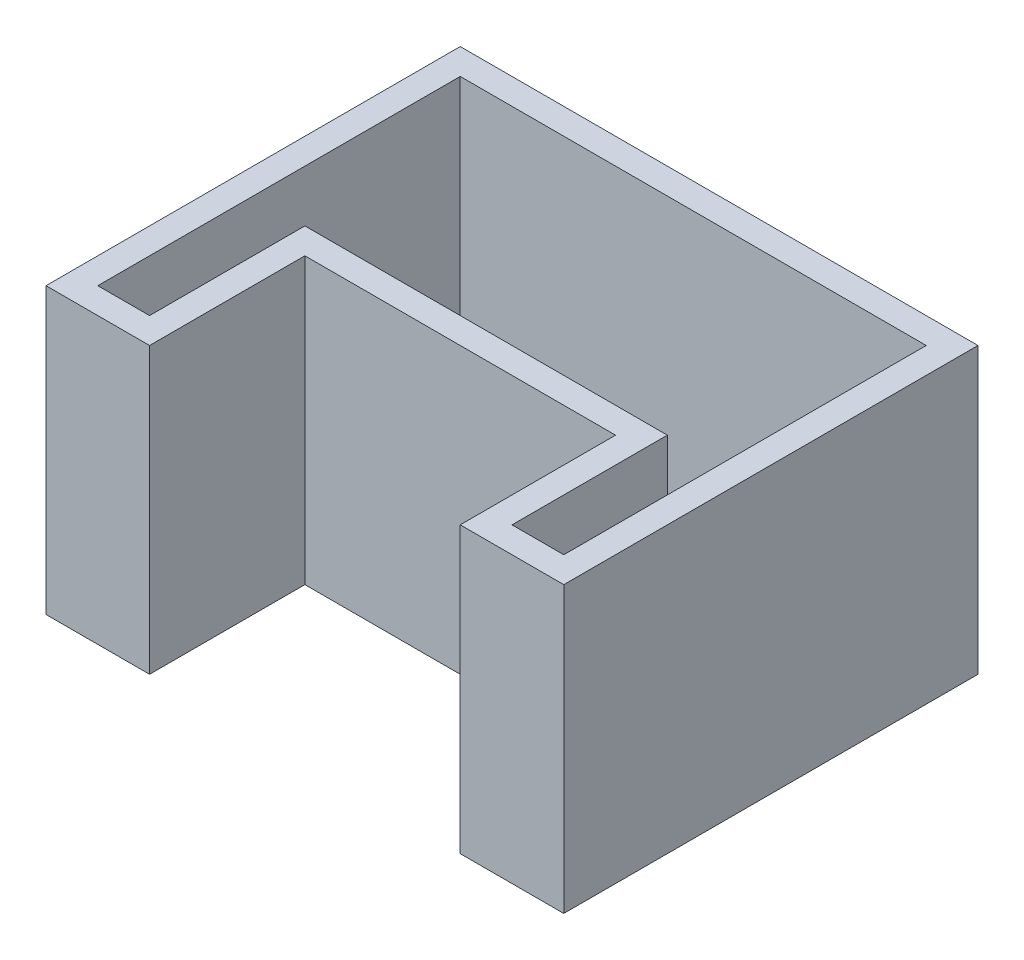
ISO-10303-21;
HEADER;
FILE_DESCRIPTION(('STEP AP214'),'2;1');
FILE_NAME('part.step','',(''),(''),'','','');
FILE_SCHEMA(('AUTOMOTIVE_DESIGN { 1 0 10303 214 1 1 1 1 }'));
ENDSEC;
DATA;
#1=APPLICATION_CONTEXT('core data for automotive mechanical design processes');
#2=APPLICATION_PROTOCOL_DEFINITION('international standard','automotive_design',2000,#1);
#3=PRODUCT_CONTEXT('',#1,'mechanical');
#4=PRODUCT('Part','Part','',(#3));
#5=PRODUCT_RELATED_PRODUCT_CATEGORY('part','',(#4));
#6=PRODUCT_DEFINITION_FORMATION('','',#4);
#7=PRODUCT_DEFINITION_CONTEXT('part definition',#1,'design');
#8=PRODUCT_DEFINITION('design','',#6,#7);
#9=PRODUCT_DEFINITION_SHAPE('','',#8);
#10=(LENGTH_UNIT() NAMED_UNIT(*) SI_UNIT(.MILLI.,.METRE.));
#11=(NAMED_UNIT(*) PLANE_ANGLE_UNIT() SI_UNIT($,.RADIAN.));
#12=(NAMED_UNIT(*) SI_UNIT($,.STERADIAN.) SOLID_ANGLE_UNIT());
#13=UNCERTAINTY_MEASURE_WITH_UNIT(LENGTH_MEASURE(1.E-05),#10,'distance_accuracy_value','');
#14=(GEOMETRIC_REPRESENTATION_CONTEXT(3) GLOBAL_UNCERTAINTY_ASSIGNED_CONTEXT((#13)) GLOBAL_UNIT_ASSIGNED_CONTEXT((#10,
#11,#12)) REPRESENTATION_CONTEXT('',''));
#15=CARTESIAN_POINT('',(0.,0.,0.));
#16=DIRECTION('',(0.,0.,1.));
#17=DIRECTION('',(1.,0.,0.));
#18=AXIS2_PLACEMENT_3D('',#15,#16,#17);
#19=CARTESIAN_POINT('',(60.,10.,80.));
#20=DIRECTION('',(0.,0.,-1.));
#21=DIRECTION('',(-1.,0.,0.));
#22=AXIS2_PLACEMENT_3D('',#19,#20,#21);
#23=PLANE('',#22);
#24=DIRECTION('',(1.,0.,0.));
#25=VECTOR('',#24,1.);
#26=CARTESIAN_POINT('',(60.,0.,80.));
#27=LINE('',#26,#25);
#28=CARTESIAN_POINT('',(60.,0.,80.));
#29=VERTEX_POINT('',#28);
#30=CARTESIAN_POINT('',(100.,0.,80.));
#31=VERTEX_POINT('',#30);
#32=EDGE_CURVE('E241',#29,#31,#27,.T.);
#33=ORIENTED_EDGE('',*,*,#32,.T.);
#34=DIRECTION('',(0.,-1.,0.));
#35=VECTOR('',#34,1.);
#36=CARTESIAN_POINT('',(100.,10.,80.));
#37=LINE('',#36,#35);
#38=CARTESIAN_POINT('',(100.,110.,80.));
#39=VERTEX_POINT('',#38);
#40=EDGE_CURVE('E11',#39,#31,#37,.T.);
#41=ORIENTED_EDGE('',*,*,#40,.F.);
#42=DIRECTION('',(1.,0.,0.));
#43=VECTOR('',#42,1.);
#44=CARTESIAN_POINT('',(60.,110.,80.));
#45=LINE('',#44,#43);
#46=CARTESIAN_POINT('',(60.,110.,80.));
#47=VERTEX_POINT('',#46);
#48=EDGE_CURVE('E229',#47,#39,#45,.T.);
#49=ORIENTED_EDGE('',*,*,#48,.F.);
#50=DIRECTION('',(0.,-1.,0.));
#51=VECTOR('',#50,1.);
#52=CARTESIAN_POINT('',(60.,10.,80.));
#53=LINE('',#52,#51);
#54=EDGE_CURVE('E257',#47,#29,#53,.T.);
#55=ORIENTED_EDGE('',*,*,#54,.T.);
#56=EDGE_LOOP('',(#33,#41,#49,#55));
#57=FACE_BOUND('',#56,.T.);
#58=ADVANCED_FACE('F33',(#57),#23,.F.);
#59=CARTESIAN_POINT('',(100.,10.,-80.));
#60=DIRECTION('',(-1.,0.,0.));
#61=DIRECTION('',(0.,0.,1.));
#62=AXIS2_PLACEMENT_3D('',#59,#60,#61);
#63=PLANE('',#62);
#64=DIRECTION('',(0.,0.,-1.));
#65=VECTOR('',#64,1.);
#66=CARTESIAN_POINT('',(100.,0.,-80.));
#67=LINE('',#66,#65);
#68=CARTESIAN_POINT('',(100.,0.,-80.));
#69=VERTEX_POINT('',#68);
#70=EDGE_CURVE('E244',#31,#69,#67,.T.);
#71=ORIENTED_EDGE('',*,*,#70,.T.);
#72=DIRECTION('',(0.,-1.,0.));
#73=VECTOR('',#72,1.);
#74=CARTESIAN_POINT('',(100.,10.,-80.));
#75=LINE('',#74,#73);
#76=CARTESIAN_POINT('',(100.,110.,-80.));
#77=VERTEX_POINT('',#76);
#78=EDGE_CURVE('E40',#77,#69,#75,.T.);
#79=ORIENTED_EDGE('',*,*,#78,.F.);
#80=DIRECTION('',(0.,0.,-1.));
#81=VECTOR('',#80,1.);
#82=CARTESIAN_POINT('',(100.,110.,80.));
#83=LINE('',#82,#81);
#84=EDGE_CURVE('E232',#39,#77,#83,.T.);
#85=ORIENTED_EDGE('',*,*,#84,.F.);
#86=ORIENTED_EDGE('',*,*,#40,.T.);
#87=EDGE_LOOP('',(#71,#79,#85,#86));
#88=FACE_BOUND('',#87,.T.);
#89=ADVANCED_FACE('F295',(#88),#63,.F.);
#90=CARTESIAN_POINT('',(-100.,10.,-80.));
#91=DIRECTION('',(0.,0.,1.));
#92=DIRECTION('',(1.,0.,0.));
#93=AXIS2_PLACEMENT_3D('',#90,#91,#92);
#94=PLANE('',#93);
#95=DIRECTION('',(-1.,0.,0.));
#96=VECTOR('',#95,1.);
#97=CARTESIAN_POINT('',(-100.,0.,-80.));
#98=LINE('',#97,#96);
#99=CARTESIAN_POINT('',(-100.,0.,-80.));
#100=VERTEX_POINT('',#99);
#101=EDGE_CURVE('E246',#69,#100,#98,.T.);
#102=ORIENTED_EDGE('',*,*,#101,.T.);
#103=DIRECTION('',(0.,-1.,0.));
#104=VECTOR('',#103,1.);
#105=CARTESIAN_POINT('',(-100.,10.,-80.));
#106=LINE('',#105,#104);
#107=CARTESIAN_POINT('',(-100.,110.,-80.));
#108=VERTEX_POINT('',#107);
#109=EDGE_CURVE('E270',#108,#100,#106,.T.);
#110=ORIENTED_EDGE('',*,*,#109,.F.);
#111=DIRECTION('',(-1.,0.,0.));
#112=VECTOR('',#111,1.);
#113=CARTESIAN_POINT('',(100.,110.,-80.));
#114=LINE('',#113,#112);
#115=EDGE_CURVE('E235',#77,#108,#114,.T.);
#116=ORIENTED_EDGE('',*,*,#115,.F.);
#117=ORIENTED_EDGE('',*,*,#78,.T.);
#118=EDGE_LOOP('',(#102,#110,#116,#117));
#119=FACE_BOUND('',#118,.T.);
#120=ADVANCED_FACE('F276',(#119),#94,.F.);
#121=CARTESIAN_POINT('',(-100.,10.,-80.));
#122=DIRECTION('',(1.,0.,0.));
#123=DIRECTION('',(0.,0.,-1.));
#124=AXIS2_PLACEMENT_3D('',#121,#122,#123);
#125=PLANE('',#124);
#126=DIRECTION('',(0.,0.,1.));
#127=VECTOR('',#126,1.);
#128=CARTESIAN_POINT('',(-100.,0.,-80.));
#129=LINE('',#128,#127);
#130=CARTESIAN_POINT('',(-100.,0.,80.));
#131=VERTEX_POINT('',#130);
#132=EDGE_CURVE('E248',#100,#131,#129,.T.);
#133=ORIENTED_EDGE('',*,*,#132,.T.);
#134=DIRECTION('',(0.,-1.,0.));
#135=VECTOR('',#134,1.);
#136=CARTESIAN_POINT('',(-100.,10.,80.));
#137=LINE('',#136,#135);
#138=CARTESIAN_POINT('',(-100.,110.,80.));
#139=VERTEX_POINT('',#138);
#140=EDGE_CURVE('E267',#139,#131,#137,.T.);
#141=ORIENTED_EDGE('',*,*,#140,.F.);
#142=DIRECTION('',(0.,0.,1.));
#143=VECTOR('',#142,1.);
#144=CARTESIAN_POINT('',(-100.,110.,-80.));
#145=LINE('',#144,#143);
#146=EDGE_CURVE('E238',#108,#139,#145,.T.);
#147=ORIENTED_EDGE('',*,*,#146,.F.);
#148=ORIENTED_EDGE('',*,*,#109,.T.);
#149=EDGE_LOOP('',(#133,#141,#147,#148));
#150=FACE_BOUND('',#149,.T.);
#151=ADVANCED_FACE('F286',(#150),#125,.F.);
#152=CARTESIAN_POINT('',(-100.,10.,80.));
#153=DIRECTION('',(0.,0.,-1.));
#154=DIRECTION('',(-1.,0.,0.));
#155=AXIS2_PLACEMENT_3D('',#152,#153,#154);
#156=PLANE('',#155);
#157=DIRECTION('',(1.,0.,0.));
#158=VECTOR('',#157,1.);
#159=CARTESIAN_POINT('',(-100.,0.,80.));
#160=LINE('',#159,#158);
#161=CARTESIAN_POINT('',(-60.,0.,80.));
#162=VERTEX_POINT('',#161);
#163=EDGE_CURVE('E250',#131,#162,#160,.T.);
#164=ORIENTED_EDGE('',*,*,#163,.T.);
#165=DIRECTION('',(0.,-1.,0.));
#166=VECTOR('',#165,1.);
#167=CARTESIAN_POINT('',(-60.,10.,80.));
#168=LINE('',#167,#166);
#169=CARTESIAN_POINT('',(-60.,110.,80.));
#170=VERTEX_POINT('',#169);
#171=EDGE_CURVE('E264',#170,#162,#168,.T.);
#172=ORIENTED_EDGE('',*,*,#171,.F.);
#173=DIRECTION('',(1.,0.,0.));
#174=VECTOR('',#173,1.);
#175=CARTESIAN_POINT('',(-100.,110.,80.));
#176=LINE('',#175,#174);
#177=EDGE_CURVE('E163',#139,#170,#176,.T.);
#178=ORIENTED_EDGE('',*,*,#177,.F.);
#179=ORIENTED_EDGE('',*,*,#140,.T.);
#180=EDGE_LOOP('',(#164,#172,#178,#179));
#181=FACE_BOUND('',#180,.T.);
#182=ADVANCED_FACE('F290',(#181),#156,.F.);
#183=CARTESIAN_POINT('',(-60.,10.,80.));
#184=DIRECTION('',(-1.,0.,0.));
#185=DIRECTION('',(0.,0.,1.));
#186=AXIS2_PLACEMENT_3D('',#183,#184,#185);
#187=PLANE('',#186);
#188=DIRECTION('',(0.,0.,-1.));
#189=VECTOR('',#188,1.);
#190=CARTESIAN_POINT('',(-60.,0.,80.));
#191=LINE('',#190,#189);
#192=CARTESIAN_POINT('',(-60.,0.,20.));
#193=VERTEX_POINT('',#192);
#194=EDGE_CURVE('E252',#162,#193,#191,.T.);
#195=ORIENTED_EDGE('',*,*,#194,.T.);
#196=DIRECTION('',(0.,-1.,0.));
#197=VECTOR('',#196,1.);
#198=CARTESIAN_POINT('',(-60.,10.,20.));
#199=LINE('',#198,#197);
#200=CARTESIAN_POINT('',(-60.,110.,20.));
#201=VERTEX_POINT('',#200);
#202=EDGE_CURVE('E261',#201,#193,#199,.T.);
#203=ORIENTED_EDGE('',*,*,#202,.F.);
#204=DIRECTION('',(0.,0.,-1.));
#205=VECTOR('',#204,1.);
#206=CARTESIAN_POINT('',(-60.,110.,80.));
#207=LINE('',#206,#205);
#208=EDGE_CURVE('E220',#170,#201,#207,.T.);
#209=ORIENTED_EDGE('',*,*,#208,.F.);
#210=ORIENTED_EDGE('',*,*,#171,.T.);
#211=EDGE_LOOP('',(#195,#203,#209,#210));
#212=FACE_BOUND('',#211,.T.);
#213=ADVANCED_FACE('F310',(#212),#187,.F.);
#214=CARTESIAN_POINT('',(-60.,10.,20.));
#215=DIRECTION('',(0.,0.,-1.));
#216=DIRECTION('',(-1.,0.,0.));
#217=AXIS2_PLACEMENT_3D('',#214,#215,#216);
#218=PLANE('',#217);
#219=DIRECTION('',(1.,0.,0.));
#220=VECTOR('',#219,1.);
#221=CARTESIAN_POINT('',(-60.,0.,20.));
#222=LINE('',#221,#220);
#223=CARTESIAN_POINT('',(60.,0.,20.));
#224=VERTEX_POINT('',#223);
#225=EDGE_CURVE('E254',#193,#224,#222,.T.);
#226=ORIENTED_EDGE('',*,*,#225,.T.);
#227=DIRECTION('',(0.,-1.,0.));
#228=VECTOR('',#227,1.);
#229=CARTESIAN_POINT('',(60.,10.,20.));
#230=LINE('',#229,#228);
#231=CARTESIAN_POINT('',(60.,110.,20.));
#232=VERTEX_POINT('',#231);
#233=EDGE_CURVE('E259',#232,#224,#230,.T.);
#234=ORIENTED_EDGE('',*,*,#233,.F.);
#235=DIRECTION('',(1.,0.,0.));
#236=VECTOR('',#235,1.);
#237=CARTESIAN_POINT('',(-60.,110.,20.));
#238=LINE('',#237,#236);
#239=EDGE_CURVE('E223',#201,#232,#238,.T.);
#240=ORIENTED_EDGE('',*,*,#239,.F.);
#241=ORIENTED_EDGE('',*,*,#202,.T.);
#242=EDGE_LOOP('',(#226,#234,#240,#241));
#243=FACE_BOUND('',#242,.T.);
#244=ADVANCED_FACE('F299',(#243),#218,.F.);
#245=CARTESIAN_POINT('',(60.,10.,20.));
#246=DIRECTION('',(1.,0.,0.));
#247=DIRECTION('',(0.,0.,-1.));
#248=AXIS2_PLACEMENT_3D('',#245,#246,#247);
#249=PLANE('',#248);
#250=DIRECTION('',(0.,0.,1.));
#251=VECTOR('',#250,1.);
#252=CARTESIAN_POINT('',(60.,0.,20.));
#253=LINE('',#252,#251);
#254=EDGE_CURVE('E55',#224,#29,#253,.T.);
#255=ORIENTED_EDGE('',*,*,#254,.T.);
#256=ORIENTED_EDGE('',*,*,#54,.F.);
#257=DIRECTION('',(0.,0.,1.));
#258=VECTOR('',#257,1.);
#259=CARTESIAN_POINT('',(60.,110.,20.));
#260=LINE('',#259,#258);
#261=EDGE_CURVE('E226',#232,#47,#260,.T.);
#262=ORIENTED_EDGE('',*,*,#261,.F.);
#263=ORIENTED_EDGE('',*,*,#233,.T.);
#264=EDGE_LOOP('',(#255,#256,#262,#263));
#265=FACE_BOUND('',#264,.T.);
#266=ADVANCED_FACE('F301',(#265),#249,.F.);
#267=CARTESIAN_POINT('',(0.,0.,0.));
#268=DIRECTION('',(0.,-1.,0.));
#269=DIRECTION('',(0.,0.,-1.));
#270=AXIS2_PLACEMENT_3D('',#267,#268,#269);
#271=PLANE('',#270);
#272=CARTESIAN_POINT('',(0.,0.,-23.0780061648739));
#273=DIRECTION('',(0.,1.,0.));
#274=DIRECTION('',(0.,0.,1.));
#275=AXIS2_PLACEMENT_3D('',#272,#273,#274);
#276=CIRCLE('',#275,5.);
#277=CARTESIAN_POINT('',(0.,0.,-18.0780061648739));
#278=VERTEX_POINT('',#277);
#279=EDGE_CURVE('E187',#278,#278,#276,.T.);
#280=ORIENTED_EDGE('',*,*,#279,.T.);
#281=EDGE_LOOP('',(#280));
#282=FACE_BOUND('',#281,.T.);
#283=ORIENTED_EDGE('',*,*,#32,.F.);
#284=ORIENTED_EDGE('',*,*,#254,.F.);
#285=ORIENTED_EDGE('',*,*,#225,.F.);
#286=ORIENTED_EDGE('',*,*,#194,.F.);
#287=ORIENTED_EDGE('',*,*,#163,.F.);
#288=ORIENTED_EDGE('',*,*,#132,.F.);
#289=ORIENTED_EDGE('',*,*,#101,.F.);
#290=ORIENTED_EDGE('',*,*,#70,.F.);
#291=EDGE_LOOP('',(#283,#284,#285,#286,#287,#288,#289,#290));
#292=FACE_BOUND('',#291,.T.);
#293=ADVANCED_FACE('F282',(#282,#292),#271,.T.);
#294=CARTESIAN_POINT('',(0.,110.,0.));
#295=DIRECTION('',(0.,1.,0.));
#296=DIRECTION('',(0.,0.,1.));
#297=AXIS2_PLACEMENT_3D('',#294,#295,#296);
#298=PLANE('',#297);
#299=ORIENTED_EDGE('',*,*,#177,.T.);
#300=ORIENTED_EDGE('',*,*,#208,.T.);
#301=ORIENTED_EDGE('',*,*,#239,.T.);
#302=ORIENTED_EDGE('',*,*,#261,.T.);
#303=ORIENTED_EDGE('',*,*,#48,.T.);
#304=ORIENTED_EDGE('',*,*,#84,.T.);
#305=ORIENTED_EDGE('',*,*,#115,.T.);
#306=ORIENTED_EDGE('',*,*,#146,.T.);
#307=EDGE_LOOP('',(#299,#300,#301,#302,#303,#304,#305,#306));
#308=FACE_BOUND('',#307,.T.);
#309=DIRECTION('',(-1.,0.,0.));
#310=VECTOR('',#309,1.);
#311=CARTESIAN_POINT('',(90.,110.,-70.));
#312=LINE('',#311,#310);
#313=CARTESIAN_POINT('',(90.,110.,-70.));
#314=VERTEX_POINT('',#313);
#315=CARTESIAN_POINT('',(-90.,110.,-70.));
#316=VERTEX_POINT('',#315);
#317=EDGE_CURVE('E155',#314,#316,#312,.T.);
#318=ORIENTED_EDGE('',*,*,#317,.F.);
#319=DIRECTION('',(0.,0.,-1.));
#320=VECTOR('',#319,1.);
#321=CARTESIAN_POINT('',(90.,110.,70.));
#322=LINE('',#321,#320);
#323=CARTESIAN_POINT('',(90.,110.,70.));
#324=VERTEX_POINT('',#323);
#325=EDGE_CURVE('E147',#324,#314,#322,.T.);
#326=ORIENTED_EDGE('',*,*,#325,.F.);
#327=DIRECTION('',(1.,0.,0.));
#328=VECTOR('',#327,1.);
#329=CARTESIAN_POINT('',(70.,110.,70.));
#330=LINE('',#329,#328);
#331=CARTESIAN_POINT('',(70.,110.,70.));
#332=VERTEX_POINT('',#331);
#333=EDGE_CURVE('E183',#332,#324,#330,.T.);
#334=ORIENTED_EDGE('',*,*,#333,.F.);
#335=DIRECTION('',(0.,0.,1.));
#336=VECTOR('',#335,1.);
#337=CARTESIAN_POINT('',(70.,110.,9.99999999999999));
#338=LINE('',#337,#336);
#339=CARTESIAN_POINT('',(70.,110.,9.99999999999999));
#340=VERTEX_POINT('',#339);
#341=EDGE_CURVE('E180',#340,#332,#338,.T.);
#342=ORIENTED_EDGE('',*,*,#341,.F.);
#343=DIRECTION('',(1.,0.,0.));
#344=VECTOR('',#343,1.);
#345=CARTESIAN_POINT('',(-70.,110.,9.99999999999999));
#346=LINE('',#345,#344);
#347=CARTESIAN_POINT('',(-70.,110.,9.99999999999999));
#348=VERTEX_POINT('',#347);
#349=EDGE_CURVE('E178',#348,#340,#346,.T.);
#350=ORIENTED_EDGE('',*,*,#349,.F.);
#351=DIRECTION('',(0.,0.,-1.));
#352=VECTOR('',#351,1.);
#353=CARTESIAN_POINT('',(-70.,110.,70.));
#354=LINE('',#353,#352);
#355=CARTESIAN_POINT('',(-70.,110.,70.));
#356=VERTEX_POINT('',#355);
#357=EDGE_CURVE('E176',#356,#348,#354,.T.);
#358=ORIENTED_EDGE('',*,*,#357,.F.);
#359=DIRECTION('',(1.,0.,0.));
#360=VECTOR('',#359,1.);
#361=CARTESIAN_POINT('',(-90.,110.,70.));
#362=LINE('',#361,#360);
#363=CARTESIAN_POINT('',(-90.,110.,70.));
#364=VERTEX_POINT('',#363);
#365=EDGE_CURVE('E171',#364,#356,#362,.T.);
#366=ORIENTED_EDGE('',*,*,#365,.F.);
#367=DIRECTION('',(0.,0.,1.));
#368=VECTOR('',#367,1.);
#369=CARTESIAN_POINT('',(-90.,110.,-70.));
#370=LINE('',#369,#368);
#371=EDGE_CURVE('E169',#316,#364,#370,.T.);
#372=ORIENTED_EDGE('',*,*,#371,.F.);
#373=EDGE_LOOP('',(#318,#326,#334,#342,#350,#358,#366,#372));
#374=FACE_BOUND('',#373,.T.);
#375=ADVANCED_FACE('F167',(#308,#374),#298,.T.);
#376=CARTESIAN_POINT('',(90.,110.,70.));
#377=DIRECTION('',(-1.,0.,0.));
#378=DIRECTION('',(0.,0.,1.));
#379=AXIS2_PLACEMENT_3D('',#376,#377,#378);
#380=PLANE('',#379);
#381=DIRECTION('',(0.,0.,-1.));
#382=VECTOR('',#381,1.);
#383=CARTESIAN_POINT('',(90.,10.,70.));
#384=LINE('',#383,#382);
#385=CARTESIAN_POINT('',(90.,10.,70.));
#386=VERTEX_POINT('',#385);
#387=CARTESIAN_POINT('',(90.,10.,-70.));
#388=VERTEX_POINT('',#387);
#389=EDGE_CURVE('E185',#386,#388,#384,.T.);
#390=ORIENTED_EDGE('',*,*,#389,.F.);
#391=DIRECTION('',(0.,-1.,0.));
#392=VECTOR('',#391,1.);
#393=CARTESIAN_POINT('',(90.,110.,70.));
#394=LINE('',#393,#392);
#395=EDGE_CURVE('E47',#324,#386,#394,.T.);
#396=ORIENTED_EDGE('',*,*,#395,.F.);
#397=ORIENTED_EDGE('',*,*,#325,.T.);
#398=DIRECTION('',(0.,-1.,0.));
#399=VECTOR('',#398,1.);
#400=CARTESIAN_POINT('',(90.,110.,-70.));
#401=LINE('',#400,#399);
#402=EDGE_CURVE('E150',#314,#388,#401,.T.);
#403=ORIENTED_EDGE('',*,*,#402,.T.);
#404=EDGE_LOOP('',(#390,#396,#397,#403));
#405=FACE_BOUND('',#404,.T.);
#406=ADVANCED_FACE('F149',(#405),#380,.T.);
#407=CARTESIAN_POINT('',(90.,110.,-70.));
#408=DIRECTION('',(0.,0.,1.));
#409=DIRECTION('',(1.,0.,0.));
#410=AXIS2_PLACEMENT_3D('',#407,#408,#409);
#411=PLANE('',#410);
#412=DIRECTION('',(-1.,0.,0.));
#413=VECTOR('',#412,1.);
#414=CARTESIAN_POINT('',(90.,10.,-70.));
#415=LINE('',#414,#413);
#416=CARTESIAN_POINT('',(-90.,10.,-70.));
#417=VERTEX_POINT('',#416);
#418=EDGE_CURVE('E162',#388,#417,#415,.T.);
#419=ORIENTED_EDGE('',*,*,#418,.F.);
#420=ORIENTED_EDGE('',*,*,#402,.F.);
#421=ORIENTED_EDGE('',*,*,#317,.T.);
#422=DIRECTION('',(0.,-1.,0.));
#423=VECTOR('',#422,1.);
#424=CARTESIAN_POINT('',(-90.,110.,-70.));
#425=LINE('',#424,#423);
#426=EDGE_CURVE('E164',#316,#417,#425,.T.);
#427=ORIENTED_EDGE('',*,*,#426,.T.);
#428=EDGE_LOOP('',(#419,#420,#421,#427));
#429=FACE_BOUND('',#428,.T.);
#430=ADVANCED_FACE('F159',(#429),#411,.T.);
#431=CARTESIAN_POINT('',(-90.,110.,-70.));
#432=DIRECTION('',(1.,0.,0.));
#433=DIRECTION('',(0.,0.,-1.));
#434=AXIS2_PLACEMENT_3D('',#431,#432,#433);
#435=PLANE('',#434);
#436=DIRECTION('',(0.,0.,1.));
#437=VECTOR('',#436,1.);
#438=CARTESIAN_POINT('',(-90.,10.,-70.));
#439=LINE('',#438,#437);
#440=CARTESIAN_POINT('',(-90.,10.,70.));
#441=VERTEX_POINT('',#440);
#442=EDGE_CURVE('E189',#417,#441,#439,.T.);
#443=ORIENTED_EDGE('',*,*,#442,.F.);
#444=ORIENTED_EDGE('',*,*,#426,.F.);
#445=ORIENTED_EDGE('',*,*,#371,.T.);
#446=DIRECTION('',(0.,-1.,0.));
#447=VECTOR('',#446,1.);
#448=CARTESIAN_POINT('',(-90.,110.,70.));
#449=LINE('',#448,#447);
#450=EDGE_CURVE('E215',#364,#441,#449,.T.);
#451=ORIENTED_EDGE('',*,*,#450,.T.);
#452=EDGE_LOOP('',(#443,#444,#445,#451));
#453=FACE_BOUND('',#452,.T.);
#454=ADVANCED_FACE('F366',(#453),#435,.T.);
#455=CARTESIAN_POINT('',(-90.,110.,70.));
#456=DIRECTION('',(0.,0.,-1.));
#457=DIRECTION('',(-1.,0.,0.));
#458=AXIS2_PLACEMENT_3D('',#455,#456,#457);
#459=PLANE('',#458);
#460=DIRECTION('',(1.,0.,0.));
#461=VECTOR('',#460,1.);
#462=CARTESIAN_POINT('',(-90.,10.,70.));
#463=LINE('',#462,#461);
#464=CARTESIAN_POINT('',(-70.,10.,70.));
#465=VERTEX_POINT('',#464);
#466=EDGE_CURVE('E192',#441,#465,#463,.T.);
#467=ORIENTED_EDGE('',*,*,#466,.F.);
#468=ORIENTED_EDGE('',*,*,#450,.F.);
#469=ORIENTED_EDGE('',*,*,#365,.T.);
#470=DIRECTION('',(0.,-1.,0.));
#471=VECTOR('',#470,1.);
#472=CARTESIAN_POINT('',(-70.,110.,70.));
#473=LINE('',#472,#471);
#474=EDGE_CURVE('E213',#356,#465,#473,.T.);
#475=ORIENTED_EDGE('',*,*,#474,.T.);
#476=EDGE_LOOP('',(#467,#468,#469,#475));
#477=FACE_BOUND('',#476,.T.);
#478=ADVANCED_FACE('F375',(#477),#459,.T.);
#479=CARTESIAN_POINT('',(-70.,110.,70.));
#480=DIRECTION('',(-1.,0.,0.));
#481=DIRECTION('',(0.,0.,1.));
#482=AXIS2_PLACEMENT_3D('',#479,#480,#481);
#483=PLANE('',#482);
#484=DIRECTION('',(0.,0.,-1.));
#485=VECTOR('',#484,1.);
#486=CARTESIAN_POINT('',(-70.,10.,70.));
#487=LINE('',#486,#485);
#488=CARTESIAN_POINT('',(-70.,10.,9.99999999999999));
#489=VERTEX_POINT('',#488);
#490=EDGE_CURVE('E195',#465,#489,#487,.T.);
#491=ORIENTED_EDGE('',*,*,#490,.F.);
#492=ORIENTED_EDGE('',*,*,#474,.F.);
#493=ORIENTED_EDGE('',*,*,#357,.T.);
#494=DIRECTION('',(0.,-1.,0.));
#495=VECTOR('',#494,1.);
#496=CARTESIAN_POINT('',(-70.,110.,9.99999999999999));
#497=LINE('',#496,#495);
#498=EDGE_CURVE('E211',#348,#489,#497,.T.);
#499=ORIENTED_EDGE('',*,*,#498,.T.);
#500=EDGE_LOOP('',(#491,#492,#493,#499));
#501=FACE_BOUND('',#500,.T.);
#502=ADVANCED_FACE('F385',(#501),#483,.T.);
#503=CARTESIAN_POINT('',(-70.,110.,9.99999999999999));
#504=DIRECTION('',(0.,0.,-1.));
#505=DIRECTION('',(-1.,0.,0.));
#506=AXIS2_PLACEMENT_3D('',#503,#504,#505);
#507=PLANE('',#506);
#508=DIRECTION('',(1.,0.,0.));
#509=VECTOR('',#508,1.);
#510=CARTESIAN_POINT('',(-70.,10.,9.99999999999999));
#511=LINE('',#510,#509);
#512=CARTESIAN_POINT('',(70.,10.,9.99999999999999));
#513=VERTEX_POINT('',#512);
#514=EDGE_CURVE('E198',#489,#513,#511,.T.);
#515=ORIENTED_EDGE('',*,*,#514,.F.);
#516=ORIENTED_EDGE('',*,*,#498,.F.);
#517=ORIENTED_EDGE('',*,*,#349,.T.);
#518=DIRECTION('',(0.,-1.,0.));
#519=VECTOR('',#518,1.);
#520=CARTESIAN_POINT('',(70.,110.,9.99999999999999));
#521=LINE('',#520,#519);
#522=EDGE_CURVE('E209',#340,#513,#521,.T.);
#523=ORIENTED_EDGE('',*,*,#522,.T.);
#524=EDGE_LOOP('',(#515,#516,#517,#523));
#525=FACE_BOUND('',#524,.T.);
#526=ADVANCED_FACE('F395',(#525),#507,.T.);
#527=CARTESIAN_POINT('',(70.,110.,9.99999999999999));
#528=DIRECTION('',(1.,0.,0.));
#529=DIRECTION('',(0.,0.,-1.));
#530=AXIS2_PLACEMENT_3D('',#527,#528,#529);
#531=PLANE('',#530);
#532=DIRECTION('',(0.,0.,1.));
#533=VECTOR('',#532,1.);
#534=CARTESIAN_POINT('',(70.,10.,9.99999999999999));
#535=LINE('',#534,#533);
#536=CARTESIAN_POINT('',(70.,10.,70.));
#537=VERTEX_POINT('',#536);
#538=EDGE_CURVE('E201',#513,#537,#535,.T.);
#539=ORIENTED_EDGE('',*,*,#538,.F.);
#540=ORIENTED_EDGE('',*,*,#522,.F.);
#541=ORIENTED_EDGE('',*,*,#341,.T.);
#542=DIRECTION('',(0.,-1.,0.));
#543=VECTOR('',#542,1.);
#544=CARTESIAN_POINT('',(70.,110.,70.));
#545=LINE('',#544,#543);
#546=EDGE_CURVE('E207',#332,#537,#545,.T.);
#547=ORIENTED_EDGE('',*,*,#546,.T.);
#548=EDGE_LOOP('',(#539,#540,#541,#547));
#549=FACE_BOUND('',#548,.T.);
#550=ADVANCED_FACE('F405',(#549),#531,.T.);
#551=CARTESIAN_POINT('',(70.,110.,70.));
#552=DIRECTION('',(0.,0.,-1.));
#553=DIRECTION('',(-1.,0.,0.));
#554=AXIS2_PLACEMENT_3D('',#551,#552,#553);
#555=PLANE('',#554);
#556=DIRECTION('',(1.,0.,0.));
#557=VECTOR('',#556,1.);
#558=CARTESIAN_POINT('',(70.,10.,70.));
#559=LINE('',#558,#557);
#560=EDGE_CURVE('E156',#537,#386,#559,.T.);
#561=ORIENTED_EDGE('',*,*,#560,.F.);
#562=ORIENTED_EDGE('',*,*,#546,.F.);
#563=ORIENTED_EDGE('',*,*,#333,.T.);
#564=ORIENTED_EDGE('',*,*,#395,.T.);
#565=EDGE_LOOP('',(#561,#562,#563,#564));
#566=FACE_BOUND('',#565,.T.);
#567=ADVANCED_FACE('F415',(#566),#555,.T.);
#568=CARTESIAN_POINT('',(0.,10.,0.));
#569=DIRECTION('',(0.,-1.,0.));
#570=DIRECTION('',(0.,0.,-1.));
#571=AXIS2_PLACEMENT_3D('',#568,#569,#570);
#572=PLANE('',#571);
#573=CARTESIAN_POINT('',(0.,10.,-23.0780061648739));
#574=DIRECTION('',(0.,1.,0.));
#575=DIRECTION('',(0.,0.,1.));
#576=AXIS2_PLACEMENT_3D('',#573,#574,#575);
#577=CIRCLE('',#576,5.);
#578=CARTESIAN_POINT('',(0.,10.,-18.0780061648739));
#579=VERTEX_POINT('',#578);
#580=EDGE_CURVE('E460',#579,#579,#577,.T.);
#581=ORIENTED_EDGE('',*,*,#580,.F.);
#582=EDGE_LOOP('',(#581));
#583=FACE_BOUND('',#582,.T.);
#584=ORIENTED_EDGE('',*,*,#560,.T.);
#585=ORIENTED_EDGE('',*,*,#389,.T.);
#586=ORIENTED_EDGE('',*,*,#418,.T.);
#587=ORIENTED_EDGE('',*,*,#442,.T.);
#588=ORIENTED_EDGE('',*,*,#466,.T.);
#589=ORIENTED_EDGE('',*,*,#490,.T.);
#590=ORIENTED_EDGE('',*,*,#514,.T.);
#591=ORIENTED_EDGE('',*,*,#538,.T.);
#592=EDGE_LOOP('',(#584,#585,#586,#587,#588,#589,#590,#591));
#593=FACE_BOUND('',#592,.T.);
#594=ADVANCED_FACE('F425',(#583,#593),#572,.F.);
#595=CARTESIAN_POINT('',(0.,0.,-23.0780061648739));
#596=DIRECTION('',(0.,1.,0.));
#597=DIRECTION('',(0.,0.,1.));
#598=AXIS2_PLACEMENT_3D('',#595,#596,#597);
#599=CYLINDRICAL_SURFACE('',#598,5.);
#600=ORIENTED_EDGE('',*,*,#279,.F.);
#601=EDGE_LOOP('',(#600));
#602=FACE_BOUND('',#601,.T.);
#603=ORIENTED_EDGE('',*,*,#580,.T.);
#604=EDGE_LOOP('',(#603));
#605=FACE_BOUND('',#604,.T.);
#606=ADVANCED_FACE('F442',(#602,#605),#599,.F.);
#607=CLOSED_SHELL('',(#58,#89,#120,#151,#182,#213,#244,#266,#293,#375,#406,#430,#454,#478,#502,
#526,#550,#567,#594,#606));
#608=MANIFOLD_SOLID_BREP('B2',#607);
#609=ADVANCED_BREP_SHAPE_REPRESENTATION('',(#18,#608),#14);
#610=SHAPE_DEFINITION_REPRESENTATION(#9,#609);
ENDSEC;
END-ISO-10303-21;
